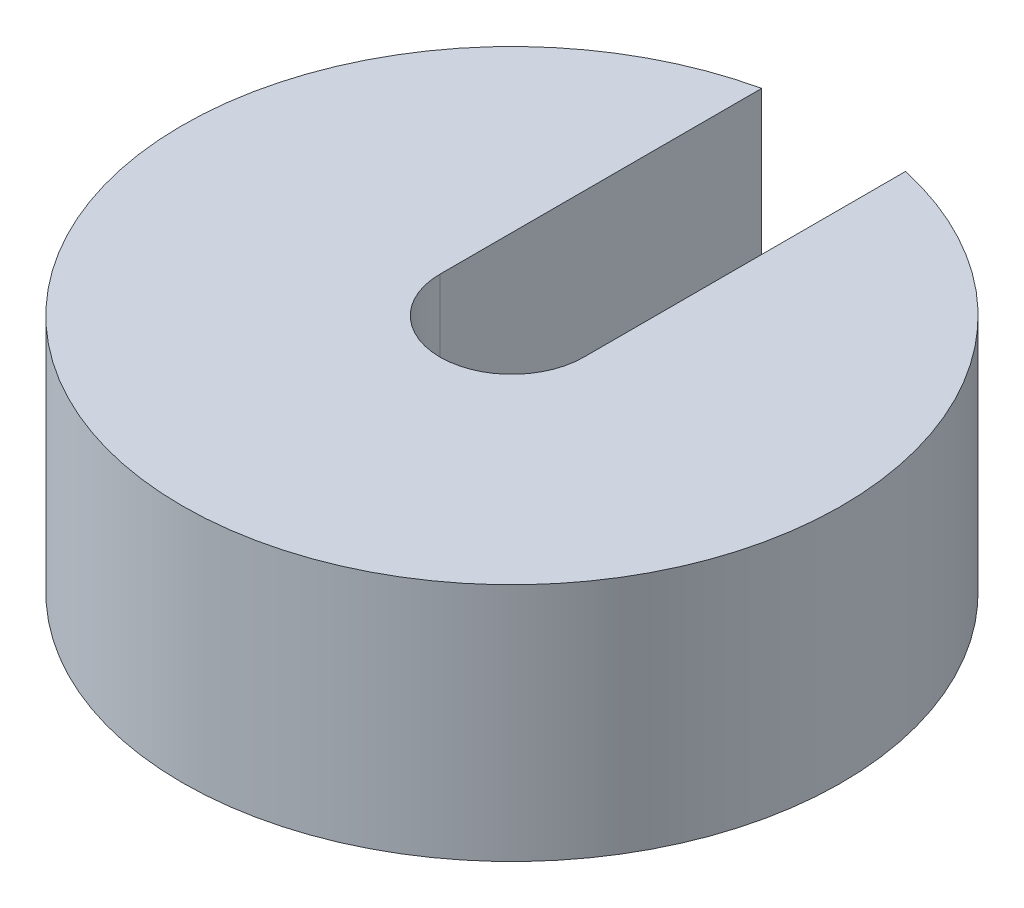
ISO-10303-21;
HEADER;
FILE_DESCRIPTION(('STEP AP214'),'2;1');
FILE_NAME('part.step','',(''),(''),'','','');
FILE_SCHEMA(('AUTOMOTIVE_DESIGN { 1 0 10303 214 1 1 1 1 }'));
ENDSEC;
DATA;
#1=APPLICATION_CONTEXT('core data for automotive mechanical design processes');
#2=APPLICATION_PROTOCOL_DEFINITION('international standard','automotive_design',2000,#1);
#3=PRODUCT_CONTEXT('',#1,'mechanical');
#4=PRODUCT('Part','Part','',(#3));
#5=PRODUCT_RELATED_PRODUCT_CATEGORY('part','',(#4));
#6=PRODUCT_DEFINITION_FORMATION('','',#4);
#7=PRODUCT_DEFINITION_CONTEXT('part definition',#1,'design');
#8=PRODUCT_DEFINITION('design','',#6,#7);
#9=PRODUCT_DEFINITION_SHAPE('','',#8);
#10=(LENGTH_UNIT() NAMED_UNIT(*) SI_UNIT(.MILLI.,.METRE.));
#11=(NAMED_UNIT(*) PLANE_ANGLE_UNIT() SI_UNIT($,.RADIAN.));
#12=(NAMED_UNIT(*) SI_UNIT($,.STERADIAN.) SOLID_ANGLE_UNIT());
#13=UNCERTAINTY_MEASURE_WITH_UNIT(LENGTH_MEASURE(1.E-05),#10,'distance_accuracy_value','');
#14=(GEOMETRIC_REPRESENTATION_CONTEXT(3) GLOBAL_UNCERTAINTY_ASSIGNED_CONTEXT((#13)) GLOBAL_UNIT_ASSIGNED_CONTEXT((#10,
#11,#12)) REPRESENTATION_CONTEXT('',''));
#15=CARTESIAN_POINT('',(0.,0.,0.));
#16=DIRECTION('',(0.,0.,1.));
#17=DIRECTION('',(1.,0.,0.));
#18=AXIS2_PLACEMENT_3D('',#15,#16,#17);
#19=CARTESIAN_POINT('',(0.,20.,0.));
#20=DIRECTION('',(0.,-1.,0.));
#21=DIRECTION('',(0.,0.,-1.));
#22=AXIS2_PLACEMENT_3D('',#19,#20,#21);
#23=CYLINDRICAL_SURFACE('',#22,6.);
#24=CARTESIAN_POINT('',(0.,0.,0.));
#25=DIRECTION('',(0.,1.,0.));
#26=DIRECTION('',(0.,0.,1.));
#27=AXIS2_PLACEMENT_3D('',#24,#25,#26);
#28=CIRCLE('',#27,6.);
#29=CARTESIAN_POINT('',(-6.,0.,0.));
#30=VERTEX_POINT('',#29);
#31=CARTESIAN_POINT('',(6.,0.,0.));
#32=VERTEX_POINT('',#31);
#33=EDGE_CURVE('E102',#30,#32,#28,.T.);
#34=ORIENTED_EDGE('',*,*,#33,.F.);
#35=DIRECTION('',(0.,-1.,0.));
#36=VECTOR('',#35,1.);
#37=CARTESIAN_POINT('',(-6.,20.,0.));
#38=LINE('',#37,#36);
#39=CARTESIAN_POINT('',(-6.,20.,0.));
#40=VERTEX_POINT('',#39);
#41=EDGE_CURVE('E11',#40,#30,#38,.T.);
#42=ORIENTED_EDGE('',*,*,#41,.F.);
#43=CARTESIAN_POINT('',(0.,20.,0.));
#44=DIRECTION('',(0.,1.,0.));
#45=DIRECTION('',(0.,0.,1.));
#46=AXIS2_PLACEMENT_3D('',#43,#44,#45);
#47=CIRCLE('',#46,6.);
#48=CARTESIAN_POINT('',(6.,20.,0.));
#49=VERTEX_POINT('',#48);
#50=EDGE_CURVE('E87',#40,#49,#47,.T.);
#51=ORIENTED_EDGE('',*,*,#50,.T.);
#52=DIRECTION('',(0.,-1.,0.));
#53=VECTOR('',#52,1.);
#54=CARTESIAN_POINT('',(6.,20.,0.));
#55=LINE('',#54,#53);
#56=EDGE_CURVE('E55',#49,#32,#55,.T.);
#57=ORIENTED_EDGE('',*,*,#56,.T.);
#58=EDGE_LOOP('',(#34,#42,#51,#57));
#59=FACE_BOUND('',#58,.T.);
#60=ADVANCED_FACE('F39',(#59),#23,.F.);
#61=CARTESIAN_POINT('',(-6.,20.,0.));
#62=DIRECTION('',(-1.,0.,0.));
#63=DIRECTION('',(0.,0.,1.));
#64=AXIS2_PLACEMENT_3D('',#61,#62,#63);
#65=PLANE('',#64);
#66=DIRECTION('',(0.,0.,-1.));
#67=VECTOR('',#66,1.);
#68=CARTESIAN_POINT('',(-6.,0.,0.));
#69=LINE('',#68,#67);
#70=CARTESIAN_POINT('',(-6.,0.,-26.8374738006393));
#71=VERTEX_POINT('',#70);
#72=EDGE_CURVE('E93',#30,#71,#69,.T.);
#73=ORIENTED_EDGE('',*,*,#72,.T.);
#74=DIRECTION('',(0.,-1.,0.));
#75=VECTOR('',#74,1.);
#76=CARTESIAN_POINT('',(-6.,20.,-26.8374738006393));
#77=LINE('',#76,#75);
#78=CARTESIAN_POINT('',(-6.,20.,-26.8374738006393));
#79=VERTEX_POINT('',#78);
#80=EDGE_CURVE('E47',#79,#71,#77,.T.);
#81=ORIENTED_EDGE('',*,*,#80,.F.);
#82=DIRECTION('',(0.,0.,-1.));
#83=VECTOR('',#82,1.);
#84=CARTESIAN_POINT('',(-6.,20.,0.));
#85=LINE('',#84,#83);
#86=EDGE_CURVE('E81',#40,#79,#85,.T.);
#87=ORIENTED_EDGE('',*,*,#86,.F.);
#88=ORIENTED_EDGE('',*,*,#41,.T.);
#89=EDGE_LOOP('',(#73,#81,#87,#88));
#90=FACE_BOUND('',#89,.T.);
#91=ADVANCED_FACE('F91',(#90),#65,.F.);
#92=CARTESIAN_POINT('',(0.,20.,0.));
#93=DIRECTION('',(0.,-1.,0.));
#94=DIRECTION('',(0.,0.,-1.));
#95=AXIS2_PLACEMENT_3D('',#92,#93,#94);
#96=CYLINDRICAL_SURFACE('',#95,27.5);
#97=CARTESIAN_POINT('',(0.,0.,0.));
#98=DIRECTION('',(0.,1.,0.));
#99=DIRECTION('',(0.,0.,1.));
#100=AXIS2_PLACEMENT_3D('',#97,#98,#99);
#101=CIRCLE('',#100,27.5);
#102=CARTESIAN_POINT('',(6.,0.,-26.8374738006393));
#103=VERTEX_POINT('',#102);
#104=EDGE_CURVE('E105',#71,#103,#101,.T.);
#105=ORIENTED_EDGE('',*,*,#104,.T.);
#106=DIRECTION('',(0.,-1.,0.));
#107=VECTOR('',#106,1.);
#108=CARTESIAN_POINT('',(6.,20.,-26.8374738006393));
#109=LINE('',#108,#107);
#110=CARTESIAN_POINT('',(6.,20.,-26.8374738006393));
#111=VERTEX_POINT('',#110);
#112=EDGE_CURVE('E69',#111,#103,#109,.T.);
#113=ORIENTED_EDGE('',*,*,#112,.F.);
#114=CARTESIAN_POINT('',(0.,20.,0.));
#115=DIRECTION('',(0.,1.,0.));
#116=DIRECTION('',(0.,0.,1.));
#117=AXIS2_PLACEMENT_3D('',#114,#115,#116);
#118=CIRCLE('',#117,27.5);
#119=EDGE_CURVE('E86',#79,#111,#118,.T.);
#120=ORIENTED_EDGE('',*,*,#119,.F.);
#121=ORIENTED_EDGE('',*,*,#80,.T.);
#122=EDGE_LOOP('',(#105,#113,#120,#121));
#123=FACE_BOUND('',#122,.T.);
#124=ADVANCED_FACE('F96',(#123),#96,.T.);
#125=CARTESIAN_POINT('',(6.,20.,0.));
#126=DIRECTION('',(-1.,0.,0.));
#127=DIRECTION('',(0.,0.,1.));
#128=AXIS2_PLACEMENT_3D('',#125,#126,#127);
#129=PLANE('',#128);
#130=DIRECTION('',(0.,0.,-1.));
#131=VECTOR('',#130,1.);
#132=CARTESIAN_POINT('',(6.,0.,0.));
#133=LINE('',#132,#131);
#134=EDGE_CURVE('E107',#32,#103,#133,.T.);
#135=ORIENTED_EDGE('',*,*,#134,.F.);
#136=ORIENTED_EDGE('',*,*,#56,.F.);
#137=DIRECTION('',(0.,0.,-1.));
#138=VECTOR('',#137,1.);
#139=CARTESIAN_POINT('',(6.,20.,0.));
#140=LINE('',#139,#138);
#141=EDGE_CURVE('E97',#49,#111,#140,.T.);
#142=ORIENTED_EDGE('',*,*,#141,.T.);
#143=ORIENTED_EDGE('',*,*,#112,.T.);
#144=EDGE_LOOP('',(#135,#136,#142,#143));
#145=FACE_BOUND('',#144,.T.);
#146=ADVANCED_FACE('F112',(#145),#129,.T.);
#147=CARTESIAN_POINT('',(0.,20.,0.));
#148=DIRECTION('',(0.,1.,0.));
#149=DIRECTION('',(0.,0.,1.));
#150=AXIS2_PLACEMENT_3D('',#147,#148,#149);
#151=PLANE('',#150);
#152=ORIENTED_EDGE('',*,*,#50,.F.);
#153=ORIENTED_EDGE('',*,*,#86,.T.);
#154=ORIENTED_EDGE('',*,*,#119,.T.);
#155=ORIENTED_EDGE('',*,*,#141,.F.);
#156=EDGE_LOOP('',(#152,#153,#154,#155));
#157=FACE_BOUND('',#156,.T.);
#158=ADVANCED_FACE('F83',(#157),#151,.T.);
#159=CARTESIAN_POINT('',(0.,0.,0.));
#160=DIRECTION('',(0.,1.,0.));
#161=DIRECTION('',(0.,0.,1.));
#162=AXIS2_PLACEMENT_3D('',#159,#160,#161);
#163=PLANE('',#162);
#164=ORIENTED_EDGE('',*,*,#33,.T.);
#165=ORIENTED_EDGE('',*,*,#134,.T.);
#166=ORIENTED_EDGE('',*,*,#104,.F.);
#167=ORIENTED_EDGE('',*,*,#72,.F.);
#168=EDGE_LOOP('',(#164,#165,#166,#167));
#169=FACE_BOUND('',#168,.T.);
#170=ADVANCED_FACE('F119',(#169),#163,.F.);
#171=CLOSED_SHELL('',(#60,#91,#124,#146,#158,#170));
#172=MANIFOLD_SOLID_BREP('B2',#171);
#173=ADVANCED_BREP_SHAPE_REPRESENTATION('',(#18,#172),#14);
#174=SHAPE_DEFINITION_REPRESENTATION(#9,#173);
ENDSEC;
END-ISO-10303-21;
